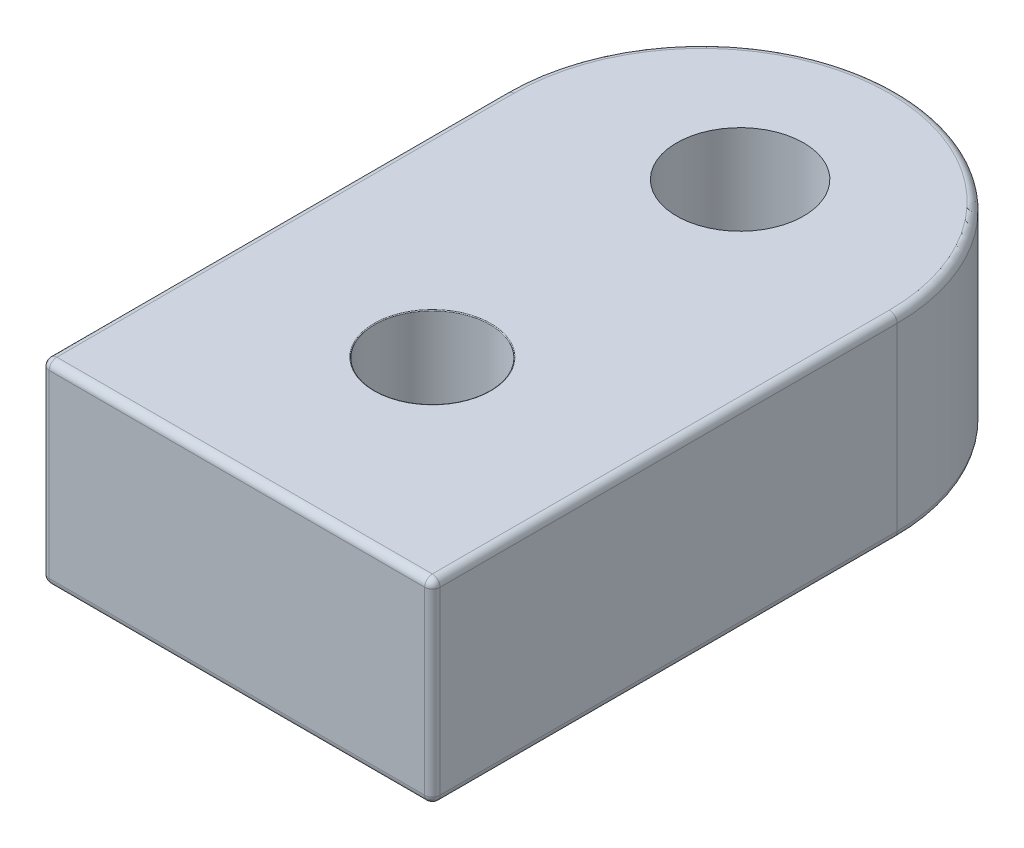
ISO-10303-21;
HEADER;
FILE_DESCRIPTION(('STEP AP214'),'2;1');
FILE_NAME('part.step','',(''),(''),'','','');
FILE_SCHEMA(('AUTOMOTIVE_DESIGN { 1 0 10303 214 1 1 1 1 }'));
ENDSEC;
DATA;
#1=APPLICATION_CONTEXT('core data for automotive mechanical design processes');
#2=APPLICATION_PROTOCOL_DEFINITION('international standard','automotive_design',2000,#1);
#3=PRODUCT_CONTEXT('',#1,'mechanical');
#4=PRODUCT('Part','Part','',(#3));
#5=PRODUCT_RELATED_PRODUCT_CATEGORY('part','',(#4));
#6=PRODUCT_DEFINITION_FORMATION('','',#4);
#7=PRODUCT_DEFINITION_CONTEXT('part definition',#1,'design');
#8=PRODUCT_DEFINITION('design','',#6,#7);
#9=PRODUCT_DEFINITION_SHAPE('','',#8);
#10=(LENGTH_UNIT() NAMED_UNIT(*) SI_UNIT(.MILLI.,.METRE.));
#11=(NAMED_UNIT(*) PLANE_ANGLE_UNIT() SI_UNIT($,.RADIAN.));
#12=(NAMED_UNIT(*) SI_UNIT($,.STERADIAN.) SOLID_ANGLE_UNIT());
#13=UNCERTAINTY_MEASURE_WITH_UNIT(LENGTH_MEASURE(1.E-05),#10,'distance_accuracy_value','');
#14=(GEOMETRIC_REPRESENTATION_CONTEXT(3) GLOBAL_UNCERTAINTY_ASSIGNED_CONTEXT((#13)) GLOBAL_UNIT_ASSIGNED_CONTEXT((#10,
#11,#12)) REPRESENTATION_CONTEXT('',''));
#15=CARTESIAN_POINT('',(0.,0.,0.));
#16=DIRECTION('',(0.,0.,1.));
#17=DIRECTION('',(1.,0.,0.));
#18=AXIS2_PLACEMENT_3D('',#15,#16,#17);
#19=CARTESIAN_POINT('',(-12.7,12.7,17.5));
#20=DIRECTION('',(1.,0.,0.));
#21=DIRECTION('',(0.,0.,-1.));
#22=AXIS2_PLACEMENT_3D('',#19,#20,#21);
#23=PLANE('',#22);
#24=DIRECTION('',(0.,0.,1.));
#25=VECTOR('',#24,1.);
#26=CARTESIAN_POINT('',(-12.7,0.5,17.5));
#27=LINE('',#26,#25);
#28=CARTESIAN_POINT('',(-12.7,0.5,-17.5));
#29=VERTEX_POINT('',#28);
#30=CARTESIAN_POINT('',(-12.7,0.5,12.2));
#31=VERTEX_POINT('',#30);
#32=EDGE_CURVE('E152',#29,#31,#27,.T.);
#33=ORIENTED_EDGE('',*,*,#32,.T.);
#34=DIRECTION('',(0.,1.,0.));
#35=VECTOR('',#34,1.);
#36=CARTESIAN_POINT('',(-12.7,12.7,12.2));
#37=LINE('',#36,#35);
#38=CARTESIAN_POINT('',(-12.7,12.2,12.2));
#39=VERTEX_POINT('',#38);
#40=EDGE_CURVE('E44',#31,#39,#37,.T.);
#41=ORIENTED_EDGE('',*,*,#40,.T.);
#42=DIRECTION('',(0.,0.,1.));
#43=VECTOR('',#42,1.);
#44=CARTESIAN_POINT('',(-12.7,12.2,-17.5));
#45=LINE('',#44,#43);
#46=CARTESIAN_POINT('',(-12.7,12.2,-17.5));
#47=VERTEX_POINT('',#46);
#48=EDGE_CURVE('E154',#39,#47,#45,.F.);
#49=ORIENTED_EDGE('',*,*,#48,.T.);
#50=DIRECTION('',(0.,-1.,0.));
#51=VECTOR('',#50,1.);
#52=CARTESIAN_POINT('',(-12.7,12.7,-17.5));
#53=LINE('',#52,#51);
#54=EDGE_CURVE('E242',#47,#29,#53,.T.);
#55=ORIENTED_EDGE('',*,*,#54,.T.);
#56=EDGE_LOOP('',(#33,#41,#49,#55));
#57=FACE_BOUND('',#56,.T.);
#58=ADVANCED_FACE('F35',(#57),#23,.F.);
#59=CARTESIAN_POINT('',(12.7,12.7,17.5));
#60=DIRECTION('',(-1.,0.,0.));
#61=DIRECTION('',(0.,0.,1.));
#62=AXIS2_PLACEMENT_3D('',#59,#60,#61);
#63=PLANE('',#62);
#64=DIRECTION('',(0.,0.,-1.));
#65=VECTOR('',#64,1.);
#66=CARTESIAN_POINT('',(12.7,12.2,17.5));
#67=LINE('',#66,#65);
#68=CARTESIAN_POINT('',(12.7,12.2,-17.5));
#69=VERTEX_POINT('',#68);
#70=CARTESIAN_POINT('',(12.7,12.2,12.2));
#71=VERTEX_POINT('',#70);
#72=EDGE_CURVE('E133',#69,#71,#67,.F.);
#73=ORIENTED_EDGE('',*,*,#72,.T.);
#74=DIRECTION('',(0.,-1.,0.));
#75=VECTOR('',#74,1.);
#76=CARTESIAN_POINT('',(12.7,12.7,12.2));
#77=LINE('',#76,#75);
#78=CARTESIAN_POINT('',(12.7,0.5,12.2));
#79=VERTEX_POINT('',#78);
#80=EDGE_CURVE('E197',#71,#79,#77,.T.);
#81=ORIENTED_EDGE('',*,*,#80,.T.);
#82=DIRECTION('',(0.,0.,-1.));
#83=VECTOR('',#82,1.);
#84=CARTESIAN_POINT('',(12.7,0.5,17.5));
#85=LINE('',#84,#83);
#86=CARTESIAN_POINT('',(12.7,0.5,-17.5));
#87=VERTEX_POINT('',#86);
#88=EDGE_CURVE('E125',#79,#87,#85,.T.);
#89=ORIENTED_EDGE('',*,*,#88,.T.);
#90=DIRECTION('',(0.,-1.,0.));
#91=VECTOR('',#90,1.);
#92=CARTESIAN_POINT('',(12.7,12.7,-17.5));
#93=LINE('',#92,#91);
#94=EDGE_CURVE('E245',#69,#87,#93,.T.);
#95=ORIENTED_EDGE('',*,*,#94,.F.);
#96=EDGE_LOOP('',(#73,#81,#89,#95));
#97=FACE_BOUND('',#96,.T.);
#98=ADVANCED_FACE('F282',(#97),#63,.F.);
#99=CARTESIAN_POINT('',(0.,12.7,0.));
#100=DIRECTION('',(0.,1.,0.));
#101=DIRECTION('',(0.,0.,1.));
#102=AXIS2_PLACEMENT_3D('',#99,#100,#101);
#103=PLANE('',#102);
#104=CARTESIAN_POINT('',(0.,12.7,-20.));
#105=DIRECTION('',(0.,-1.,0.));
#106=DIRECTION('',(0.,0.,-1.));
#107=AXIS2_PLACEMENT_3D('',#104,#105,#106);
#108=CIRCLE('',#107,4.125);
#109=CARTESIAN_POINT('',(0.,12.7,-24.125));
#110=VERTEX_POINT('',#109);
#111=EDGE_CURVE('E178',#110,#110,#108,.T.);
#112=ORIENTED_EDGE('',*,*,#111,.T.);
#113=EDGE_LOOP('',(#112));
#114=FACE_BOUND('',#113,.T.);
#115=DIRECTION('',(0.,0.,1.));
#116=VECTOR('',#115,1.);
#117=CARTESIAN_POINT('',(-12.2,12.7,17.5));
#118=LINE('',#117,#116);
#119=CARTESIAN_POINT('',(-12.2,12.7,-17.5));
#120=VERTEX_POINT('',#119);
#121=CARTESIAN_POINT('',(-12.2,12.7,12.2));
#122=VERTEX_POINT('',#121);
#123=EDGE_CURVE('E126',#120,#122,#118,.T.);
#124=ORIENTED_EDGE('',*,*,#123,.T.);
#125=DIRECTION('',(-1.,0.,0.));
#126=VECTOR('',#125,1.);
#127=CARTESIAN_POINT('',(12.2,12.7,12.2));
#128=LINE('',#127,#126);
#129=CARTESIAN_POINT('',(12.2,12.7,12.2));
#130=VERTEX_POINT('',#129);
#131=EDGE_CURVE('E123',#122,#130,#128,.F.);
#132=ORIENTED_EDGE('',*,*,#131,.T.);
#133=DIRECTION('',(0.,0.,-1.));
#134=VECTOR('',#133,1.);
#135=CARTESIAN_POINT('',(12.2,12.7,-17.5));
#136=LINE('',#135,#134);
#137=CARTESIAN_POINT('',(12.2,12.7,-17.5));
#138=VERTEX_POINT('',#137);
#139=EDGE_CURVE('E114',#130,#138,#136,.T.);
#140=ORIENTED_EDGE('',*,*,#139,.T.);
#141=CARTESIAN_POINT('',(0.,12.7,-17.5));
#142=DIRECTION('',(0.,1.,0.));
#143=DIRECTION('',(0.,0.,1.));
#144=AXIS2_PLACEMENT_3D('',#141,#142,#143);
#145=CIRCLE('',#144,12.2);
#146=EDGE_CURVE('E120',#138,#120,#145,.T.);
#147=ORIENTED_EDGE('',*,*,#146,.T.);
#148=EDGE_LOOP('',(#124,#132,#140,#147));
#149=FACE_BOUND('',#148,.T.);
#150=CARTESIAN_POINT('',(0.,12.7,0.));
#151=DIRECTION('',(0.,1.,0.));
#152=DIRECTION('',(0.,0.,1.));
#153=AXIS2_PLACEMENT_3D('',#150,#151,#152);
#154=CIRCLE('',#153,3.8);
#155=CARTESIAN_POINT('',(0.,12.7,3.8));
#156=VERTEX_POINT('',#155);
#157=EDGE_CURVE('E142',#156,#156,#154,.F.);
#158=ORIENTED_EDGE('',*,*,#157,.T.);
#159=EDGE_LOOP('',(#158));
#160=FACE_BOUND('',#159,.T.);
#161=ADVANCED_FACE('F117',(#114,#149,#160),#103,.T.);
#162=CARTESIAN_POINT('',(0.,0.,0.));
#163=DIRECTION('',(0.,1.,0.));
#164=DIRECTION('',(0.,0.,1.));
#165=AXIS2_PLACEMENT_3D('',#162,#163,#164);
#166=PLANE('',#165);
#167=CARTESIAN_POINT('',(0.,0.,-10.16));
#168=DIRECTION('',(0.,1.,0.));
#169=DIRECTION('',(0.,0.,1.));
#170=AXIS2_PLACEMENT_3D('',#167,#168,#169);
#171=CIRCLE('',#170,0.9);
#172=CARTESIAN_POINT('',(0.,0.,-9.26));
#173=VERTEX_POINT('',#172);
#174=EDGE_CURVE('E182',#173,#173,#171,.F.);
#175=ORIENTED_EDGE('',*,*,#174,.F.);
#176=EDGE_LOOP('',(#175));
#177=FACE_BOUND('',#176,.T.);
#178=CARTESIAN_POINT('',(0.,0.,10.16));
#179=DIRECTION('',(0.,1.,0.));
#180=DIRECTION('',(0.,0.,1.));
#181=AXIS2_PLACEMENT_3D('',#178,#179,#180);
#182=CIRCLE('',#181,0.9);
#183=CARTESIAN_POINT('',(0.,0.,11.06));
#184=VERTEX_POINT('',#183);
#185=EDGE_CURVE('E179',#184,#184,#182,.F.);
#186=ORIENTED_EDGE('',*,*,#185,.F.);
#187=EDGE_LOOP('',(#186));
#188=FACE_BOUND('',#187,.T.);
#189=CARTESIAN_POINT('',(0.,0.,-20.));
#190=DIRECTION('',(0.,1.,0.));
#191=DIRECTION('',(0.,0.,1.));
#192=AXIS2_PLACEMENT_3D('',#189,#190,#191);
#193=CIRCLE('',#192,4.125);
#194=CARTESIAN_POINT('',(0.,0.,-15.875));
#195=VERTEX_POINT('',#194);
#196=EDGE_CURVE('E173',#195,#195,#193,.T.);
#197=ORIENTED_EDGE('',*,*,#196,.T.);
#198=EDGE_LOOP('',(#197));
#199=FACE_BOUND('',#198,.T.);
#200=DIRECTION('',(0.,0.,-1.));
#201=VECTOR('',#200,1.);
#202=CARTESIAN_POINT('',(12.2,0.,0.));
#203=LINE('',#202,#201);
#204=CARTESIAN_POINT('',(12.2,0.,-17.5));
#205=VERTEX_POINT('',#204);
#206=CARTESIAN_POINT('',(12.2,0.,12.2));
#207=VERTEX_POINT('',#206);
#208=EDGE_CURVE('E160',#205,#207,#203,.F.);
#209=ORIENTED_EDGE('',*,*,#208,.T.);
#210=DIRECTION('',(-1.,0.,0.));
#211=VECTOR('',#210,1.);
#212=CARTESIAN_POINT('',(0.,0.,12.2));
#213=LINE('',#212,#211);
#214=CARTESIAN_POINT('',(-12.2,0.,12.2));
#215=VERTEX_POINT('',#214);
#216=EDGE_CURVE('E201',#207,#215,#213,.T.);
#217=ORIENTED_EDGE('',*,*,#216,.T.);
#218=DIRECTION('',(0.,0.,1.));
#219=VECTOR('',#218,1.);
#220=CARTESIAN_POINT('',(-12.2,0.,0.));
#221=LINE('',#220,#219);
#222=CARTESIAN_POINT('',(-12.2,0.,-17.5));
#223=VERTEX_POINT('',#222);
#224=EDGE_CURVE('E156',#215,#223,#221,.F.);
#225=ORIENTED_EDGE('',*,*,#224,.T.);
#226=CARTESIAN_POINT('',(0.,0.,-17.5));
#227=DIRECTION('',(0.,1.,0.));
#228=DIRECTION('',(0.,0.,1.));
#229=AXIS2_PLACEMENT_3D('',#226,#227,#228);
#230=CIRCLE('',#229,12.2);
#231=EDGE_CURVE('E158',#223,#205,#230,.F.);
#232=ORIENTED_EDGE('',*,*,#231,.T.);
#233=EDGE_LOOP('',(#209,#217,#225,#232));
#234=FACE_BOUND('',#233,.T.);
#235=CARTESIAN_POINT('',(0.,0.,0.));
#236=DIRECTION('',(0.,1.,0.));
#237=DIRECTION('',(0.,0.,1.));
#238=AXIS2_PLACEMENT_3D('',#235,#236,#237);
#239=CIRCLE('',#238,2.05);
#240=CARTESIAN_POINT('',(0.,0.,2.05));
#241=VERTEX_POINT('',#240);
#242=EDGE_CURVE('E169',#241,#241,#239,.T.);
#243=ORIENTED_EDGE('',*,*,#242,.T.);
#244=EDGE_LOOP('',(#243));
#245=FACE_BOUND('',#244,.T.);
#246=ADVANCED_FACE('F290',(#177,#188,#199,#234,#245),#166,.F.);
#247=CARTESIAN_POINT('',(0.,7.83955145132135,0.));
#248=DIRECTION('',(0.,1.,0.));
#249=DIRECTION('',(0.,0.,1.));
#250=AXIS2_PLACEMENT_3D('',#247,#248,#249);
#251=CYLINDRICAL_SURFACE('',#250,3.75);
#252=CARTESIAN_POINT('',(0.,4.55,0.));
#253=DIRECTION('',(0.,1.,0.));
#254=DIRECTION('',(0.,0.,1.));
#255=AXIS2_PLACEMENT_3D('',#252,#253,#254);
#256=CIRCLE('',#255,3.75);
#257=CARTESIAN_POINT('',(0.,4.55,3.75));
#258=VERTEX_POINT('',#257);
#259=EDGE_CURVE('E257',#258,#258,#256,.F.);
#260=ORIENTED_EDGE('',*,*,#259,.T.);
#261=EDGE_LOOP('',(#260));
#262=FACE_BOUND('',#261,.T.);
#263=CARTESIAN_POINT('',(0.,12.65,0.));
#264=DIRECTION('',(0.,1.,0.));
#265=DIRECTION('',(0.,0.,1.));
#266=AXIS2_PLACEMENT_3D('',#263,#264,#265);
#267=CIRCLE('',#266,3.75);
#268=CARTESIAN_POINT('',(0.,12.65,3.75));
#269=VERTEX_POINT('',#268);
#270=EDGE_CURVE('E254',#269,#269,#267,.T.);
#271=ORIENTED_EDGE('',*,*,#270,.T.);
#272=EDGE_LOOP('',(#271));
#273=FACE_BOUND('',#272,.T.);
#274=ADVANCED_FACE('F293',(#262,#273),#251,.F.);
#275=CARTESIAN_POINT('',(3.75,4.5,0.));
#276=DIRECTION('',(0.,1.,0.));
#277=DIRECTION('',(0.,0.,1.));
#278=AXIS2_PLACEMENT_3D('',#275,#276,#277);
#279=PLANE('',#278);
#280=CARTESIAN_POINT('',(0.,4.5,0.));
#281=DIRECTION('',(0.,1.,0.));
#282=DIRECTION('',(0.,0.,1.));
#283=AXIS2_PLACEMENT_3D('',#280,#281,#282);
#284=CIRCLE('',#283,3.7);
#285=CARTESIAN_POINT('',(0.,4.5,3.7));
#286=VERTEX_POINT('',#285);
#287=EDGE_CURVE('E251',#286,#286,#284,.T.);
#288=ORIENTED_EDGE('',*,*,#287,.T.);
#289=EDGE_LOOP('',(#288));
#290=FACE_BOUND('',#289,.T.);
#291=CARTESIAN_POINT('',(0.,4.5,0.));
#292=DIRECTION('',(0.,1.,0.));
#293=DIRECTION('',(0.,0.,1.));
#294=AXIS2_PLACEMENT_3D('',#291,#292,#293);
#295=CIRCLE('',#294,2.1);
#296=CARTESIAN_POINT('',(0.,4.5,2.1));
#297=VERTEX_POINT('',#296);
#298=EDGE_CURVE('E248',#297,#297,#295,.F.);
#299=ORIENTED_EDGE('',*,*,#298,.T.);
#300=EDGE_LOOP('',(#299));
#301=FACE_BOUND('',#300,.T.);
#302=ADVANCED_FACE('F300',(#290,#301),#279,.T.);
#303=CARTESIAN_POINT('',(0.,7.83955145132135,0.));
#304=DIRECTION('',(0.,1.,0.));
#305=DIRECTION('',(0.,0.,1.));
#306=AXIS2_PLACEMENT_3D('',#303,#304,#305);
#307=CYLINDRICAL_SURFACE('',#306,2.05);
#308=CARTESIAN_POINT('',(0.,4.45,0.));
#309=DIRECTION('',(0.,1.,0.));
#310=DIRECTION('',(0.,0.,1.));
#311=AXIS2_PLACEMENT_3D('',#308,#309,#310);
#312=CIRCLE('',#311,2.05);
#313=CARTESIAN_POINT('',(0.,4.45,2.05));
#314=VERTEX_POINT('',#313);
#315=EDGE_CURVE('E146',#314,#314,#312,.T.);
#316=ORIENTED_EDGE('',*,*,#315,.T.);
#317=EDGE_LOOP('',(#316));
#318=FACE_BOUND('',#317,.T.);
#319=ORIENTED_EDGE('',*,*,#242,.F.);
#320=EDGE_LOOP('',(#319));
#321=FACE_BOUND('',#320,.T.);
#322=ADVANCED_FACE('F262',(#318,#321),#307,.F.);
#323=CARTESIAN_POINT('',(0.,4.55,0.));
#324=DIRECTION('',(0.,1.,0.));
#325=DIRECTION('',(0.,0.,1.));
#326=AXIS2_PLACEMENT_3D('',#323,#324,#325);
#327=TOROIDAL_SURFACE('',#326,3.7,0.05);
#328=ORIENTED_EDGE('',*,*,#259,.F.);
#329=EDGE_LOOP('',(#328));
#330=FACE_BOUND('',#329,.T.);
#331=ORIENTED_EDGE('',*,*,#287,.F.);
#332=EDGE_LOOP('',(#331));
#333=FACE_BOUND('',#332,.T.);
#334=ADVANCED_FACE('F268',(#330,#333),#327,.F.);
#335=CARTESIAN_POINT('',(0.,4.45,0.));
#336=DIRECTION('',(0.,1.,0.));
#337=DIRECTION('',(0.,0.,1.));
#338=AXIS2_PLACEMENT_3D('',#335,#336,#337);
#339=TOROIDAL_SURFACE('',#338,2.1,0.05);
#340=ORIENTED_EDGE('',*,*,#298,.F.);
#341=EDGE_LOOP('',(#340));
#342=FACE_BOUND('',#341,.T.);
#343=ORIENTED_EDGE('',*,*,#315,.F.);
#344=EDGE_LOOP('',(#343));
#345=FACE_BOUND('',#344,.T.);
#346=ADVANCED_FACE('F265',(#342,#345),#339,.T.);
#347=CARTESIAN_POINT('',(0.,12.65,0.));
#348=DIRECTION('',(0.,1.,0.));
#349=DIRECTION('',(0.,0.,1.));
#350=AXIS2_PLACEMENT_3D('',#347,#348,#349);
#351=TOROIDAL_SURFACE('',#350,3.8,0.05);
#352=ORIENTED_EDGE('',*,*,#157,.F.);
#353=EDGE_LOOP('',(#352));
#354=FACE_BOUND('',#353,.T.);
#355=ORIENTED_EDGE('',*,*,#270,.F.);
#356=EDGE_LOOP('',(#355));
#357=FACE_BOUND('',#356,.T.);
#358=ADVANCED_FACE('F267',(#354,#357),#351,.T.);
#359=CARTESIAN_POINT('',(0.,-28.3980633142473,-17.5));
#360=DIRECTION('',(0.,1.,0.));
#361=DIRECTION('',(0.,0.,1.));
#362=AXIS2_PLACEMENT_3D('',#359,#360,#361);
#363=CYLINDRICAL_SURFACE('',#362,12.7);
#364=ORIENTED_EDGE('',*,*,#94,.T.);
#365=CARTESIAN_POINT('',(0.,0.5,-17.5));
#366=DIRECTION('',(0.,1.,0.));
#367=DIRECTION('',(0.,0.,1.));
#368=AXIS2_PLACEMENT_3D('',#365,#366,#367);
#369=CIRCLE('',#368,12.7);
#370=EDGE_CURVE('E165',#87,#29,#369,.T.);
#371=ORIENTED_EDGE('',*,*,#370,.T.);
#372=ORIENTED_EDGE('',*,*,#54,.F.);
#373=CARTESIAN_POINT('',(0.,12.2,-17.5));
#374=DIRECTION('',(0.,1.,0.));
#375=DIRECTION('',(0.,0.,1.));
#376=AXIS2_PLACEMENT_3D('',#373,#374,#375);
#377=CIRCLE('',#376,12.7);
#378=EDGE_CURVE('E163',#47,#69,#377,.F.);
#379=ORIENTED_EDGE('',*,*,#378,.T.);
#380=EDGE_LOOP('',(#364,#371,#372,#379));
#381=FACE_BOUND('',#380,.T.);
#382=ADVANCED_FACE('F275',(#381),#363,.T.);
#383=CARTESIAN_POINT('',(-12.2,12.2,0.));
#384=DIRECTION('',(0.,0.,-1.));
#385=DIRECTION('',(-1.,0.,0.));
#386=AXIS2_PLACEMENT_3D('',#383,#384,#385);
#387=CYLINDRICAL_SURFACE('',#386,0.5);
#388=ORIENTED_EDGE('',*,*,#48,.F.);
#389=CARTESIAN_POINT('',(-12.2,12.2,12.2));
#390=DIRECTION('',(0.,0.,-1.));
#391=DIRECTION('',(-1.,0.,0.));
#392=AXIS2_PLACEMENT_3D('',#389,#390,#391);
#393=CIRCLE('',#392,0.5);
#394=EDGE_CURVE('E11',#39,#122,#393,.T.);
#395=ORIENTED_EDGE('',*,*,#394,.T.);
#396=ORIENTED_EDGE('',*,*,#123,.F.);
#397=CARTESIAN_POINT('',(-12.2,12.2,-17.5));
#398=DIRECTION('',(0.,0.,-1.));
#399=DIRECTION('',(-1.,0.,0.));
#400=AXIS2_PLACEMENT_3D('',#397,#398,#399);
#401=CIRCLE('',#400,0.5);
#402=EDGE_CURVE('E136',#47,#120,#401,.T.);
#403=ORIENTED_EDGE('',*,*,#402,.F.);
#404=EDGE_LOOP('',(#388,#395,#396,#403));
#405=FACE_BOUND('',#404,.T.);
#406=ADVANCED_FACE('F309',(#405),#387,.T.);
#407=CARTESIAN_POINT('',(0.,12.2,-17.5));
#408=DIRECTION('',(0.,1.,0.));
#409=DIRECTION('',(0.,0.,1.));
#410=AXIS2_PLACEMENT_3D('',#407,#408,#409);
#411=TOROIDAL_SURFACE('',#410,12.2,0.5);
#412=ORIENTED_EDGE('',*,*,#402,.T.);
#413=ORIENTED_EDGE('',*,*,#146,.F.);
#414=CARTESIAN_POINT('',(12.2,12.2,-17.5));
#415=DIRECTION('',(0.,0.,1.));
#416=DIRECTION('',(1.,0.,0.));
#417=AXIS2_PLACEMENT_3D('',#414,#415,#416);
#418=CIRCLE('',#417,0.5);
#419=EDGE_CURVE('E130',#69,#138,#418,.T.);
#420=ORIENTED_EDGE('',*,*,#419,.F.);
#421=ORIENTED_EDGE('',*,*,#378,.F.);
#422=EDGE_LOOP('',(#412,#413,#420,#421));
#423=FACE_BOUND('',#422,.T.);
#424=ADVANCED_FACE('F140',(#423),#411,.T.);
#425=CARTESIAN_POINT('',(12.2,12.2,0.));
#426=DIRECTION('',(0.,0.,1.));
#427=DIRECTION('',(1.,0.,0.));
#428=AXIS2_PLACEMENT_3D('',#425,#426,#427);
#429=CYLINDRICAL_SURFACE('',#428,0.5);
#430=ORIENTED_EDGE('',*,*,#139,.F.);
#431=CARTESIAN_POINT('',(12.2,12.2,12.2));
#432=DIRECTION('',(0.,0.,1.));
#433=DIRECTION('',(1.,0.,0.));
#434=AXIS2_PLACEMENT_3D('',#431,#432,#433);
#435=CIRCLE('',#434,0.5);
#436=EDGE_CURVE('E195',#130,#71,#435,.F.);
#437=ORIENTED_EDGE('',*,*,#436,.T.);
#438=ORIENTED_EDGE('',*,*,#72,.F.);
#439=ORIENTED_EDGE('',*,*,#419,.T.);
#440=EDGE_LOOP('',(#430,#437,#438,#439));
#441=FACE_BOUND('',#440,.T.);
#442=ADVANCED_FACE('F131',(#441),#429,.T.);
#443=CARTESIAN_POINT('',(-12.2,0.5,17.5));
#444=DIRECTION('',(0.,0.,1.));
#445=DIRECTION('',(1.,0.,0.));
#446=AXIS2_PLACEMENT_3D('',#443,#444,#445);
#447=CYLINDRICAL_SURFACE('',#446,0.5);
#448=ORIENTED_EDGE('',*,*,#224,.F.);
#449=CARTESIAN_POINT('',(-12.2,0.5,12.2));
#450=DIRECTION('',(0.,0.,1.));
#451=DIRECTION('',(1.,0.,0.));
#452=AXIS2_PLACEMENT_3D('',#449,#450,#451);
#453=CIRCLE('',#452,0.5);
#454=EDGE_CURVE('E59',#215,#31,#453,.F.);
#455=ORIENTED_EDGE('',*,*,#454,.T.);
#456=ORIENTED_EDGE('',*,*,#32,.F.);
#457=CARTESIAN_POINT('',(-12.2,0.5,-17.5));
#458=DIRECTION('',(0.,0.,-1.));
#459=DIRECTION('',(-1.,0.,0.));
#460=AXIS2_PLACEMENT_3D('',#457,#458,#459);
#461=CIRCLE('',#460,0.5);
#462=EDGE_CURVE('E137',#223,#29,#461,.T.);
#463=ORIENTED_EDGE('',*,*,#462,.F.);
#464=EDGE_LOOP('',(#448,#455,#456,#463));
#465=FACE_BOUND('',#464,.T.);
#466=ADVANCED_FACE('F384',(#465),#447,.T.);
#467=CARTESIAN_POINT('',(0.,0.5,-17.5));
#468=DIRECTION('',(0.,1.,0.));
#469=DIRECTION('',(0.,0.,1.));
#470=AXIS2_PLACEMENT_3D('',#467,#468,#469);
#471=TOROIDAL_SURFACE('',#470,12.2,0.5);
#472=ORIENTED_EDGE('',*,*,#462,.T.);
#473=ORIENTED_EDGE('',*,*,#370,.F.);
#474=CARTESIAN_POINT('',(12.2,0.5,-17.5));
#475=DIRECTION('',(0.,0.,1.));
#476=DIRECTION('',(1.,0.,0.));
#477=AXIS2_PLACEMENT_3D('',#474,#475,#476);
#478=CIRCLE('',#477,0.5);
#479=EDGE_CURVE('E170',#205,#87,#478,.T.);
#480=ORIENTED_EDGE('',*,*,#479,.F.);
#481=ORIENTED_EDGE('',*,*,#231,.F.);
#482=EDGE_LOOP('',(#472,#473,#480,#481));
#483=FACE_BOUND('',#482,.T.);
#484=ADVANCED_FACE('F381',(#483),#471,.T.);
#485=CARTESIAN_POINT('',(12.2,0.5,17.5));
#486=DIRECTION('',(0.,0.,-1.));
#487=DIRECTION('',(-1.,0.,0.));
#488=AXIS2_PLACEMENT_3D('',#485,#486,#487);
#489=CYLINDRICAL_SURFACE('',#488,0.5);
#490=ORIENTED_EDGE('',*,*,#88,.F.);
#491=CARTESIAN_POINT('',(12.2,0.5,12.2));
#492=DIRECTION('',(0.,0.,-1.));
#493=DIRECTION('',(-1.,0.,0.));
#494=AXIS2_PLACEMENT_3D('',#491,#492,#493);
#495=CIRCLE('',#494,0.5);
#496=EDGE_CURVE('E199',#79,#207,#495,.T.);
#497=ORIENTED_EDGE('',*,*,#496,.T.);
#498=ORIENTED_EDGE('',*,*,#208,.F.);
#499=ORIENTED_EDGE('',*,*,#479,.T.);
#500=EDGE_LOOP('',(#490,#497,#498,#499));
#501=FACE_BOUND('',#500,.T.);
#502=ADVANCED_FACE('F315',(#501),#489,.T.);
#503=CARTESIAN_POINT('',(15.5007514943222,-2.,12.7));
#504=DIRECTION('',(0.,0.,-1.));
#505=DIRECTION('',(-1.,0.,0.));
#506=AXIS2_PLACEMENT_3D('',#503,#504,#505);
#507=PLANE('',#506);
#508=DIRECTION('',(0.,-1.,0.));
#509=VECTOR('',#508,1.);
#510=CARTESIAN_POINT('',(12.2,-2.,12.7));
#511=LINE('',#510,#509);
#512=CARTESIAN_POINT('',(12.2,0.5,12.7));
#513=VERTEX_POINT('',#512);
#514=CARTESIAN_POINT('',(12.2,12.2,12.7));
#515=VERTEX_POINT('',#514);
#516=EDGE_CURVE('E189',#513,#515,#511,.F.);
#517=ORIENTED_EDGE('',*,*,#516,.T.);
#518=DIRECTION('',(-1.,0.,0.));
#519=VECTOR('',#518,1.);
#520=CARTESIAN_POINT('',(-12.2,12.2,12.7));
#521=LINE('',#520,#519);
#522=CARTESIAN_POINT('',(-12.2,12.2,12.7));
#523=VERTEX_POINT('',#522);
#524=EDGE_CURVE('E191',#515,#523,#521,.T.);
#525=ORIENTED_EDGE('',*,*,#524,.T.);
#526=DIRECTION('',(0.,1.,0.));
#527=VECTOR('',#526,1.);
#528=CARTESIAN_POINT('',(-12.2,-2.,12.7));
#529=LINE('',#528,#527);
#530=CARTESIAN_POINT('',(-12.2,0.5,12.7));
#531=VERTEX_POINT('',#530);
#532=EDGE_CURVE('E166',#523,#531,#529,.F.);
#533=ORIENTED_EDGE('',*,*,#532,.T.);
#534=DIRECTION('',(-1.,0.,0.));
#535=VECTOR('',#534,1.);
#536=CARTESIAN_POINT('',(15.5007514943222,0.5,12.7));
#537=LINE('',#536,#535);
#538=EDGE_CURVE('E187',#531,#513,#537,.F.);
#539=ORIENTED_EDGE('',*,*,#538,.T.);
#540=EDGE_LOOP('',(#517,#525,#533,#539));
#541=FACE_BOUND('',#540,.T.);
#542=ADVANCED_FACE('F311',(#541),#507,.F.);
#543=CARTESIAN_POINT('',(0.,12.7,-20.));
#544=DIRECTION('',(0.,-1.,0.));
#545=DIRECTION('',(0.,0.,-1.));
#546=AXIS2_PLACEMENT_3D('',#543,#544,#545);
#547=CYLINDRICAL_SURFACE('',#546,4.125);
#548=ORIENTED_EDGE('',*,*,#111,.F.);
#549=EDGE_LOOP('',(#548));
#550=FACE_BOUND('',#549,.T.);
#551=ORIENTED_EDGE('',*,*,#196,.F.);
#552=EDGE_LOOP('',(#551));
#553=FACE_BOUND('',#552,.T.);
#554=ADVANCED_FACE('F314',(#550,#553),#547,.F.);
#555=CARTESIAN_POINT('',(0.,-2.,10.16));
#556=DIRECTION('',(0.,1.,0.));
#557=DIRECTION('',(0.,0.,1.));
#558=AXIS2_PLACEMENT_3D('',#555,#556,#557);
#559=CYLINDRICAL_SURFACE('',#558,0.9);
#560=CARTESIAN_POINT('',(0.,5.,10.16));
#561=DIRECTION('',(0.,-1.,0.));
#562=DIRECTION('',(0.,0.,-1.));
#563=AXIS2_PLACEMENT_3D('',#560,#561,#562);
#564=CIRCLE('',#563,0.9);
#565=CARTESIAN_POINT('',(0.,5.,9.26));
#566=VERTEX_POINT('',#565);
#567=EDGE_CURVE('E226',#566,#566,#564,.T.);
#568=ORIENTED_EDGE('',*,*,#567,.F.);
#569=EDGE_LOOP('',(#568));
#570=FACE_BOUND('',#569,.T.);
#571=ORIENTED_EDGE('',*,*,#185,.T.);
#572=EDGE_LOOP('',(#571));
#573=FACE_BOUND('',#572,.T.);
#574=ADVANCED_FACE('F319',(#570,#573),#559,.F.);
#575=CARTESIAN_POINT('',(0.,5.,10.16));
#576=DIRECTION('',(0.,-1.,0.));
#577=DIRECTION('',(0.,0.,-1.));
#578=AXIS2_PLACEMENT_3D('',#575,#576,#577);
#579=PLANE('',#578);
#580=ORIENTED_EDGE('',*,*,#567,.T.);
#581=EDGE_LOOP('',(#580));
#582=FACE_BOUND('',#581,.T.);
#583=ADVANCED_FACE('F323',(#582),#579,.T.);
#584=CARTESIAN_POINT('',(0.,-2.,-10.16));
#585=DIRECTION('',(0.,1.,0.));
#586=DIRECTION('',(0.,0.,1.));
#587=AXIS2_PLACEMENT_3D('',#584,#585,#586);
#588=CYLINDRICAL_SURFACE('',#587,0.9);
#589=CARTESIAN_POINT('',(0.,5.,-10.16));
#590=DIRECTION('',(0.,-1.,0.));
#591=DIRECTION('',(0.,0.,-1.));
#592=AXIS2_PLACEMENT_3D('',#589,#590,#591);
#593=CIRCLE('',#592,0.9);
#594=CARTESIAN_POINT('',(0.,5.,-11.06));
#595=VERTEX_POINT('',#594);
#596=EDGE_CURVE('E183',#595,#595,#593,.T.);
#597=ORIENTED_EDGE('',*,*,#596,.F.);
#598=EDGE_LOOP('',(#597));
#599=FACE_BOUND('',#598,.T.);
#600=ORIENTED_EDGE('',*,*,#174,.T.);
#601=EDGE_LOOP('',(#600));
#602=FACE_BOUND('',#601,.T.);
#603=ADVANCED_FACE('F327',(#599,#602),#588,.F.);
#604=CARTESIAN_POINT('',(0.,5.,-10.16));
#605=DIRECTION('',(0.,-1.,0.));
#606=DIRECTION('',(0.,0.,-1.));
#607=AXIS2_PLACEMENT_3D('',#604,#605,#606);
#608=PLANE('',#607);
#609=ORIENTED_EDGE('',*,*,#596,.T.);
#610=EDGE_LOOP('',(#609));
#611=FACE_BOUND('',#610,.T.);
#612=ADVANCED_FACE('F330',(#611),#608,.T.);
#613=CARTESIAN_POINT('',(0.,0.5,12.2));
#614=DIRECTION('',(-1.,0.,0.));
#615=DIRECTION('',(0.,0.,1.));
#616=AXIS2_PLACEMENT_3D('',#613,#614,#615);
#617=CYLINDRICAL_SURFACE('',#616,0.5);
#618=CARTESIAN_POINT('',(-12.2,0.5,12.2));
#619=DIRECTION('',(-1.,0.,0.));
#620=DIRECTION('',(0.,0.,1.));
#621=AXIS2_PLACEMENT_3D('',#618,#619,#620);
#622=CIRCLE('',#621,0.5);
#623=EDGE_CURVE('E220',#215,#531,#622,.T.);
#624=ORIENTED_EDGE('',*,*,#623,.F.);
#625=ORIENTED_EDGE('',*,*,#216,.F.);
#626=CARTESIAN_POINT('',(12.2,0.5,12.2));
#627=DIRECTION('',(1.,0.,0.));
#628=DIRECTION('',(0.,0.,-1.));
#629=AXIS2_PLACEMENT_3D('',#626,#627,#628);
#630=CIRCLE('',#629,0.5);
#631=EDGE_CURVE('E39',#513,#207,#630,.T.);
#632=ORIENTED_EDGE('',*,*,#631,.F.);
#633=ORIENTED_EDGE('',*,*,#538,.F.);
#634=EDGE_LOOP('',(#624,#625,#632,#633));
#635=FACE_BOUND('',#634,.T.);
#636=ADVANCED_FACE('F37',(#635),#617,.T.);
#637=CARTESIAN_POINT('',(12.2,0.5,12.2));
#638=DIRECTION('',(0.,0.,-1.));
#639=DIRECTION('',(-1.,0.,0.));
#640=AXIS2_PLACEMENT_3D('',#637,#638,#639);
#641=SPHERICAL_SURFACE('',#640,0.5);
#642=ORIENTED_EDGE('',*,*,#631,.T.);
#643=ORIENTED_EDGE('',*,*,#496,.F.);
#644=CARTESIAN_POINT('',(12.2,0.5,12.2));
#645=DIRECTION('',(0.,1.,0.));
#646=DIRECTION('',(0.,0.,1.));
#647=AXIS2_PLACEMENT_3D('',#644,#645,#646);
#648=CIRCLE('',#647,0.5);
#649=EDGE_CURVE('E218',#513,#79,#648,.T.);
#650=ORIENTED_EDGE('',*,*,#649,.F.);
#651=EDGE_LOOP('',(#642,#643,#650));
#652=FACE_BOUND('',#651,.T.);
#653=ADVANCED_FACE('F337',(#652),#641,.T.);
#654=CARTESIAN_POINT('',(-12.2,0.5,12.2));
#655=DIRECTION('',(0.,0.,-1.));
#656=DIRECTION('',(-1.,0.,0.));
#657=AXIS2_PLACEMENT_3D('',#654,#655,#656);
#658=SPHERICAL_SURFACE('',#657,0.5);
#659=ORIENTED_EDGE('',*,*,#454,.F.);
#660=ORIENTED_EDGE('',*,*,#623,.T.);
#661=CARTESIAN_POINT('',(-12.2,0.5,12.2));
#662=DIRECTION('',(0.,1.,0.));
#663=DIRECTION('',(0.,0.,1.));
#664=AXIS2_PLACEMENT_3D('',#661,#662,#663);
#665=CIRCLE('',#664,0.5);
#666=EDGE_CURVE('E215',#31,#531,#665,.T.);
#667=ORIENTED_EDGE('',*,*,#666,.F.);
#668=EDGE_LOOP('',(#659,#660,#667));
#669=FACE_BOUND('',#668,.T.);
#670=ADVANCED_FACE('F355',(#669),#658,.T.);
#671=CARTESIAN_POINT('',(12.2,12.7,12.2));
#672=DIRECTION('',(0.,-1.,0.));
#673=DIRECTION('',(0.,0.,-1.));
#674=AXIS2_PLACEMENT_3D('',#671,#672,#673);
#675=CYLINDRICAL_SURFACE('',#674,0.5);
#676=ORIENTED_EDGE('',*,*,#649,.T.);
#677=ORIENTED_EDGE('',*,*,#80,.F.);
#678=CARTESIAN_POINT('',(12.2,12.2,12.2));
#679=DIRECTION('',(0.,1.,0.));
#680=DIRECTION('',(0.,0.,1.));
#681=AXIS2_PLACEMENT_3D('',#678,#679,#680);
#682=CIRCLE('',#681,0.5);
#683=EDGE_CURVE('E212',#515,#71,#682,.T.);
#684=ORIENTED_EDGE('',*,*,#683,.F.);
#685=ORIENTED_EDGE('',*,*,#516,.F.);
#686=EDGE_LOOP('',(#676,#677,#684,#685));
#687=FACE_BOUND('',#686,.T.);
#688=ADVANCED_FACE('F377',(#687),#675,.T.);
#689=CARTESIAN_POINT('',(-12.2,12.7,12.2));
#690=DIRECTION('',(0.,1.,0.));
#691=DIRECTION('',(0.,0.,1.));
#692=AXIS2_PLACEMENT_3D('',#689,#690,#691);
#693=CYLINDRICAL_SURFACE('',#692,0.5);
#694=ORIENTED_EDGE('',*,*,#666,.T.);
#695=ORIENTED_EDGE('',*,*,#532,.F.);
#696=CARTESIAN_POINT('',(-12.2,12.2,12.2));
#697=DIRECTION('',(0.,1.,0.));
#698=DIRECTION('',(0.,0.,1.));
#699=AXIS2_PLACEMENT_3D('',#696,#697,#698);
#700=CIRCLE('',#699,0.5);
#701=EDGE_CURVE('E209',#39,#523,#700,.T.);
#702=ORIENTED_EDGE('',*,*,#701,.F.);
#703=ORIENTED_EDGE('',*,*,#40,.F.);
#704=EDGE_LOOP('',(#694,#695,#702,#703));
#705=FACE_BOUND('',#704,.T.);
#706=ADVANCED_FACE('F359',(#705),#693,.T.);
#707=CARTESIAN_POINT('',(12.2,12.2,12.2));
#708=DIRECTION('',(0.,0.,-1.));
#709=DIRECTION('',(-1.,0.,0.));
#710=AXIS2_PLACEMENT_3D('',#707,#708,#709);
#711=SPHERICAL_SURFACE('',#710,0.5);
#712=ORIENTED_EDGE('',*,*,#683,.T.);
#713=ORIENTED_EDGE('',*,*,#436,.F.);
#714=CARTESIAN_POINT('',(12.2,12.2,12.2));
#715=DIRECTION('',(-1.,0.,0.));
#716=DIRECTION('',(0.,0.,1.));
#717=AXIS2_PLACEMENT_3D('',#714,#715,#716);
#718=CIRCLE('',#717,0.5);
#719=EDGE_CURVE('E207',#515,#130,#718,.T.);
#720=ORIENTED_EDGE('',*,*,#719,.F.);
#721=EDGE_LOOP('',(#712,#713,#720));
#722=FACE_BOUND('',#721,.T.);
#723=ADVANCED_FACE('F371',(#722),#711,.T.);
#724=CARTESIAN_POINT('',(-12.2,12.2,12.2));
#725=DIRECTION('',(0.,0.,-1.));
#726=DIRECTION('',(-1.,0.,0.));
#727=AXIS2_PLACEMENT_3D('',#724,#725,#726);
#728=SPHERICAL_SURFACE('',#727,0.5);
#729=ORIENTED_EDGE('',*,*,#394,.F.);
#730=ORIENTED_EDGE('',*,*,#701,.T.);
#731=CARTESIAN_POINT('',(-12.2,12.2,12.2));
#732=DIRECTION('',(1.,0.,0.));
#733=DIRECTION('',(0.,0.,-1.));
#734=AXIS2_PLACEMENT_3D('',#731,#732,#733);
#735=CIRCLE('',#734,0.5);
#736=EDGE_CURVE('E205',#122,#523,#735,.T.);
#737=ORIENTED_EDGE('',*,*,#736,.F.);
#738=EDGE_LOOP('',(#729,#730,#737));
#739=FACE_BOUND('',#738,.T.);
#740=ADVANCED_FACE('F363',(#739),#728,.T.);
#741=CARTESIAN_POINT('',(15.5007514943222,12.2,12.2));
#742=DIRECTION('',(1.,0.,0.));
#743=DIRECTION('',(0.,0.,-1.));
#744=AXIS2_PLACEMENT_3D('',#741,#742,#743);
#745=CYLINDRICAL_SURFACE('',#744,0.5);
#746=ORIENTED_EDGE('',*,*,#719,.T.);
#747=ORIENTED_EDGE('',*,*,#131,.F.);
#748=ORIENTED_EDGE('',*,*,#736,.T.);
#749=ORIENTED_EDGE('',*,*,#524,.F.);
#750=EDGE_LOOP('',(#746,#747,#748,#749));
#751=FACE_BOUND('',#750,.T.);
#752=ADVANCED_FACE('F366',(#751),#745,.T.);
#753=CLOSED_SHELL('',(#58,#98,#161,#246,#274,#302,#322,#334,#346,#358,#382,#406,#424,#442,#466,
#484,#502,#542,#554,#574,#583,#603,#612,#636,#653,#670,#688,#706,#723,#740,#752));
#754=MANIFOLD_SOLID_BREP('B2',#753);
#755=ADVANCED_BREP_SHAPE_REPRESENTATION('',(#18,#754),#14);
#756=SHAPE_DEFINITION_REPRESENTATION(#9,#755);
ENDSEC;
END-ISO-10303-21;
